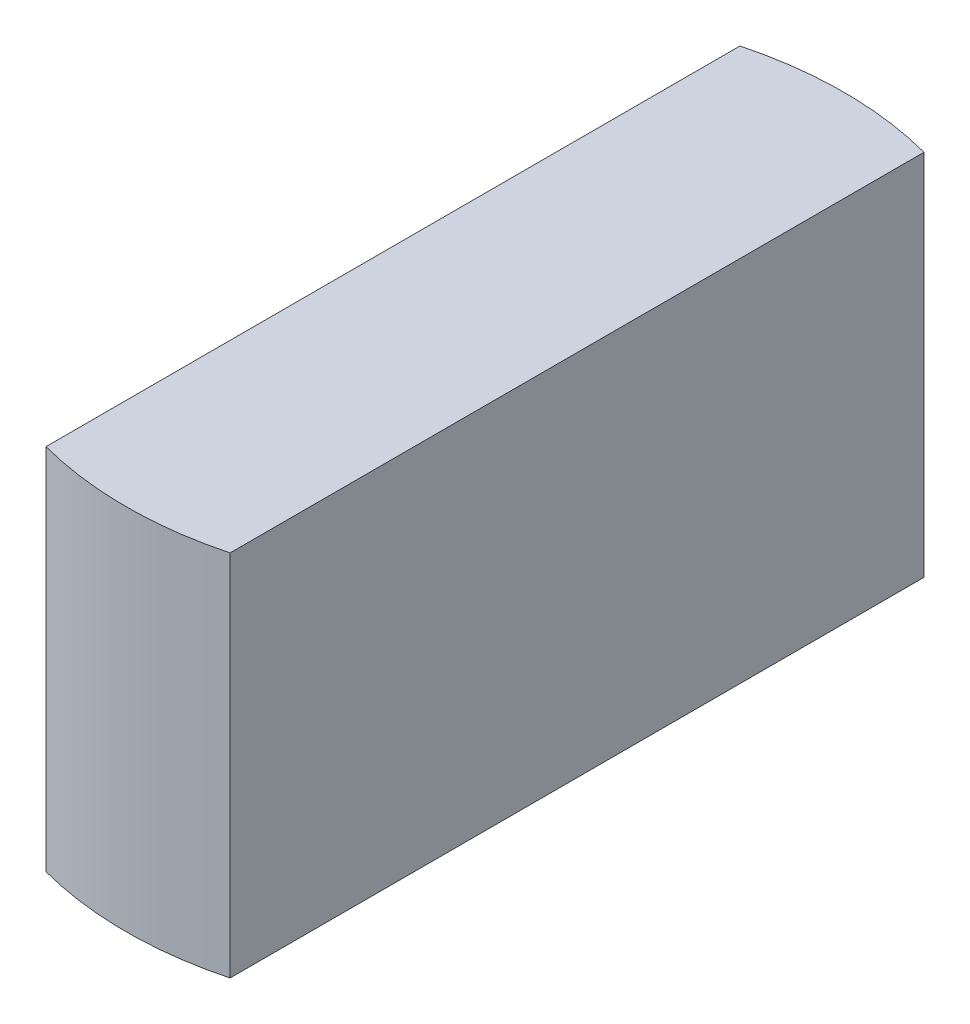
ISO-10303-21;
HEADER;
FILE_DESCRIPTION(('STEP AP214'),'2;1');
FILE_NAME('part.step','',(''),(''),'','','');
FILE_SCHEMA(('AUTOMOTIVE_DESIGN { 1 0 10303 214 1 1 1 1 }'));
ENDSEC;
DATA;
#1=APPLICATION_CONTEXT('core data for automotive mechanical design processes');
#2=APPLICATION_PROTOCOL_DEFINITION('international standard','automotive_design',2000,#1);
#3=PRODUCT_CONTEXT('',#1,'mechanical');
#4=PRODUCT('Part','Part','',(#3));
#5=PRODUCT_RELATED_PRODUCT_CATEGORY('part','',(#4));
#6=PRODUCT_DEFINITION_FORMATION('','',#4);
#7=PRODUCT_DEFINITION_CONTEXT('part definition',#1,'design');
#8=PRODUCT_DEFINITION('design','',#6,#7);
#9=PRODUCT_DEFINITION_SHAPE('','',#8);
#10=(LENGTH_UNIT() NAMED_UNIT(*) SI_UNIT(.MILLI.,.METRE.));
#11=(NAMED_UNIT(*) PLANE_ANGLE_UNIT() SI_UNIT($,.RADIAN.));
#12=(NAMED_UNIT(*) SI_UNIT($,.STERADIAN.) SOLID_ANGLE_UNIT());
#13=UNCERTAINTY_MEASURE_WITH_UNIT(LENGTH_MEASURE(1.E-05),#10,'distance_accuracy_value','');
#14=(GEOMETRIC_REPRESENTATION_CONTEXT(3) GLOBAL_UNCERTAINTY_ASSIGNED_CONTEXT((#13)) GLOBAL_UNIT_ASSIGNED_CONTEXT((#10,
#11,#12)) REPRESENTATION_CONTEXT('',''));
#15=CARTESIAN_POINT('',(0.,0.,0.));
#16=DIRECTION('',(0.,0.,1.));
#17=DIRECTION('',(1.,0.,0.));
#18=AXIS2_PLACEMENT_3D('',#15,#16,#17);
#19=CARTESIAN_POINT('',(0.,-2.,8.22));
#20=DIRECTION('',(0.,1.,0.));
#21=DIRECTION('',(0.,0.,-1.));
#22=AXIS2_PLACEMENT_3D('',#19,#20,#21);
#23=PLANE('',#22);
#24=CARTESIAN_POINT('',(0.,-2.,8.22));
#25=DIRECTION('',(0.,1.,0.));
#26=DIRECTION('',(-1.,0.,0.));
#27=AXIS2_PLACEMENT_3D('',#24,#25,#26);
#28=CIRCLE('',#27,3.9);
#29=CARTESIAN_POINT('',(1.,-2.,4.45038463500585));
#30=VERTEX_POINT('',#29);
#31=CARTESIAN_POINT('',(-1.,-2.,4.45038463500585));
#32=VERTEX_POINT('',#31);
#33=EDGE_CURVE('E112',#30,#32,#28,.T.);
#34=ORIENTED_EDGE('',*,*,#33,.F.);
#35=DIRECTION('',(0.,0.,-1.));
#36=VECTOR('',#35,1.);
#37=CARTESIAN_POINT('',(1.,-2.,11.9896153649941));
#38=LINE('',#37,#36);
#39=CARTESIAN_POINT('',(1.,-2.,11.9896153649941));
#40=VERTEX_POINT('',#39);
#41=EDGE_CURVE('E11',#40,#30,#38,.T.);
#42=ORIENTED_EDGE('',*,*,#41,.F.);
#43=CARTESIAN_POINT('',(0.,-2.,8.22));
#44=DIRECTION('',(0.,1.,0.));
#45=DIRECTION('',(-1.,0.,0.));
#46=AXIS2_PLACEMENT_3D('',#43,#44,#45);
#47=CIRCLE('',#46,3.9);
#48=CARTESIAN_POINT('',(-1.,-2.,11.9896153649941));
#49=VERTEX_POINT('',#48);
#50=EDGE_CURVE('E76',#49,#40,#47,.T.);
#51=ORIENTED_EDGE('',*,*,#50,.F.);
#52=DIRECTION('',(0.,0.,1.));
#53=VECTOR('',#52,1.);
#54=CARTESIAN_POINT('',(-1.,-2.,4.45038463500585));
#55=LINE('',#54,#53);
#56=EDGE_CURVE('E89',#32,#49,#55,.T.);
#57=ORIENTED_EDGE('',*,*,#56,.F.);
#58=EDGE_LOOP('',(#34,#42,#51,#57));
#59=FACE_BOUND('',#58,.T.);
#60=ADVANCED_FACE('F17',(#59),#23,.F.);
#61=CARTESIAN_POINT('',(1.,2.,11.9896153649941));
#62=DIRECTION('',(-1.,0.,0.));
#63=DIRECTION('',(0.,0.,1.));
#64=AXIS2_PLACEMENT_3D('',#61,#62,#63);
#65=PLANE('',#64);
#66=ORIENTED_EDGE('',*,*,#41,.T.);
#67=DIRECTION('',(0.,-1.,0.));
#68=VECTOR('',#67,1.);
#69=CARTESIAN_POINT('',(1.,2.,4.45038463500585));
#70=LINE('',#69,#68);
#71=CARTESIAN_POINT('',(1.,2.,4.45038463500585));
#72=VERTEX_POINT('',#71);
#73=EDGE_CURVE('E84',#72,#30,#70,.T.);
#74=ORIENTED_EDGE('',*,*,#73,.F.);
#75=DIRECTION('',(0.,0.,-1.));
#76=VECTOR('',#75,1.);
#77=CARTESIAN_POINT('',(1.,2.,11.9896153649941));
#78=LINE('',#77,#76);
#79=CARTESIAN_POINT('',(1.,2.,11.9896153649941));
#80=VERTEX_POINT('',#79);
#81=EDGE_CURVE('E81',#80,#72,#78,.T.);
#82=ORIENTED_EDGE('',*,*,#81,.F.);
#83=DIRECTION('',(0.,-1.,0.));
#84=VECTOR('',#83,1.);
#85=CARTESIAN_POINT('',(1.,2.,11.9896153649941));
#86=LINE('',#85,#84);
#87=EDGE_CURVE('E28',#80,#40,#86,.T.);
#88=ORIENTED_EDGE('',*,*,#87,.T.);
#89=EDGE_LOOP('',(#66,#74,#82,#88));
#90=FACE_BOUND('',#89,.T.);
#91=ADVANCED_FACE('F82',(#90),#65,.F.);
#92=CARTESIAN_POINT('',(0.,2.,8.22));
#93=DIRECTION('',(0.,1.,0.));
#94=DIRECTION('',(0.,0.,1.));
#95=AXIS2_PLACEMENT_3D('',#92,#93,#94);
#96=CYLINDRICAL_SURFACE('',#95,3.9);
#97=ORIENTED_EDGE('',*,*,#50,.T.);
#98=ORIENTED_EDGE('',*,*,#87,.F.);
#99=CARTESIAN_POINT('',(0.,2.,8.22));
#100=DIRECTION('',(0.,1.,0.));
#101=DIRECTION('',(-1.,0.,0.));
#102=AXIS2_PLACEMENT_3D('',#99,#100,#101);
#103=CIRCLE('',#102,3.9);
#104=CARTESIAN_POINT('',(-1.,2.,11.9896153649941));
#105=VERTEX_POINT('',#104);
#106=EDGE_CURVE('E21',#105,#80,#103,.T.);
#107=ORIENTED_EDGE('',*,*,#106,.F.);
#108=DIRECTION('',(0.,-1.,0.));
#109=VECTOR('',#108,1.);
#110=CARTESIAN_POINT('',(-1.,2.,11.9896153649941));
#111=LINE('',#110,#109);
#112=EDGE_CURVE('E65',#105,#49,#111,.T.);
#113=ORIENTED_EDGE('',*,*,#112,.T.);
#114=EDGE_LOOP('',(#97,#98,#107,#113));
#115=FACE_BOUND('',#114,.T.);
#116=ADVANCED_FACE('F73',(#115),#96,.T.);
#117=CARTESIAN_POINT('',(-1.,2.,4.45038463500585));
#118=DIRECTION('',(1.,0.,0.));
#119=DIRECTION('',(0.,0.,1.));
#120=AXIS2_PLACEMENT_3D('',#117,#118,#119);
#121=PLANE('',#120);
#122=ORIENTED_EDGE('',*,*,#56,.T.);
#123=ORIENTED_EDGE('',*,*,#112,.F.);
#124=DIRECTION('',(0.,0.,1.));
#125=VECTOR('',#124,1.);
#126=CARTESIAN_POINT('',(-1.,2.,4.45038463500585));
#127=LINE('',#126,#125);
#128=CARTESIAN_POINT('',(-1.,2.,4.45038463500585));
#129=VERTEX_POINT('',#128);
#130=EDGE_CURVE('E91',#129,#105,#127,.T.);
#131=ORIENTED_EDGE('',*,*,#130,.F.);
#132=DIRECTION('',(0.,-1.,0.));
#133=VECTOR('',#132,1.);
#134=CARTESIAN_POINT('',(-1.,2.,4.45038463500585));
#135=LINE('',#134,#133);
#136=EDGE_CURVE('E104',#129,#32,#135,.T.);
#137=ORIENTED_EDGE('',*,*,#136,.T.);
#138=EDGE_LOOP('',(#122,#123,#131,#137));
#139=FACE_BOUND('',#138,.T.);
#140=ADVANCED_FACE('F117',(#139),#121,.F.);
#141=CARTESIAN_POINT('',(0.,2.,8.22));
#142=DIRECTION('',(0.,1.,0.));
#143=DIRECTION('',(0.,0.,-1.));
#144=AXIS2_PLACEMENT_3D('',#141,#142,#143);
#145=PLANE('',#144);
#146=CARTESIAN_POINT('',(0.,2.,8.22));
#147=DIRECTION('',(0.,1.,0.));
#148=DIRECTION('',(-1.,0.,0.));
#149=AXIS2_PLACEMENT_3D('',#146,#147,#148);
#150=CIRCLE('',#149,3.9);
#151=EDGE_CURVE('E101',#72,#129,#150,.T.);
#152=ORIENTED_EDGE('',*,*,#151,.T.);
#153=ORIENTED_EDGE('',*,*,#130,.T.);
#154=ORIENTED_EDGE('',*,*,#106,.T.);
#155=ORIENTED_EDGE('',*,*,#81,.T.);
#156=EDGE_LOOP('',(#152,#153,#154,#155));
#157=FACE_BOUND('',#156,.T.);
#158=ADVANCED_FACE('F19',(#157),#145,.T.);
#159=CARTESIAN_POINT('',(0.,2.,8.22));
#160=DIRECTION('',(0.,1.,0.));
#161=DIRECTION('',(0.,0.,1.));
#162=AXIS2_PLACEMENT_3D('',#159,#160,#161);
#163=CYLINDRICAL_SURFACE('',#162,3.9);
#164=ORIENTED_EDGE('',*,*,#33,.T.);
#165=ORIENTED_EDGE('',*,*,#136,.F.);
#166=ORIENTED_EDGE('',*,*,#151,.F.);
#167=ORIENTED_EDGE('',*,*,#73,.T.);
#168=EDGE_LOOP('',(#164,#165,#166,#167));
#169=FACE_BOUND('',#168,.T.);
#170=ADVANCED_FACE('F120',(#169),#163,.T.);
#171=CLOSED_SHELL('',(#60,#91,#116,#140,#158,#170));
#172=MANIFOLD_SOLID_BREP('B1',#171);
#173=ADVANCED_BREP_SHAPE_REPRESENTATION('',(#18,#172),#14);
#174=SHAPE_DEFINITION_REPRESENTATION(#9,#173);
ENDSEC;
END-ISO-10303-21;
